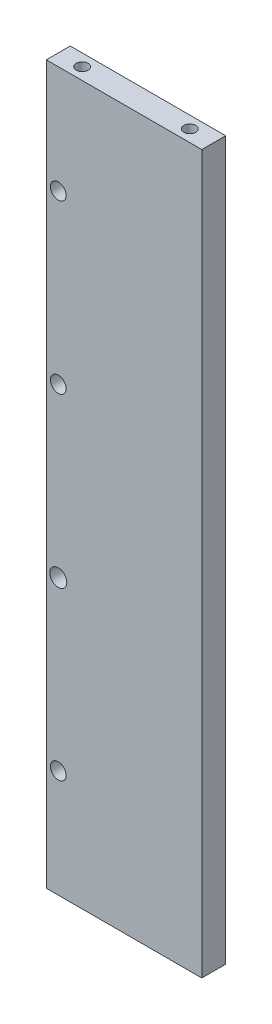
ISO-10303-21;
HEADER;
FILE_DESCRIPTION(('STEP AP214'),'2;1');
FILE_NAME('part.step','',(''),(''),'','','');
FILE_SCHEMA(('AUTOMOTIVE_DESIGN { 1 0 10303 214 1 1 1 1 }'));
ENDSEC;
DATA;
#1=APPLICATION_CONTEXT('core data for automotive mechanical design processes');
#2=APPLICATION_PROTOCOL_DEFINITION('international standard','automotive_design',2000,#1);
#3=PRODUCT_CONTEXT('',#1,'mechanical');
#4=PRODUCT('Part','Part','',(#3));
#5=PRODUCT_RELATED_PRODUCT_CATEGORY('part','',(#4));
#6=PRODUCT_DEFINITION_FORMATION('','',#4);
#7=PRODUCT_DEFINITION_CONTEXT('part definition',#1,'design');
#8=PRODUCT_DEFINITION('design','',#6,#7);
#9=PRODUCT_DEFINITION_SHAPE('','',#8);
#10=(LENGTH_UNIT() NAMED_UNIT(*) SI_UNIT(.MILLI.,.METRE.));
#11=(NAMED_UNIT(*) PLANE_ANGLE_UNIT() SI_UNIT($,.RADIAN.));
#12=(NAMED_UNIT(*) SI_UNIT($,.STERADIAN.) SOLID_ANGLE_UNIT());
#13=UNCERTAINTY_MEASURE_WITH_UNIT(LENGTH_MEASURE(1.E-05),#10,'distance_accuracy_value','');
#14=(GEOMETRIC_REPRESENTATION_CONTEXT(3) GLOBAL_UNCERTAINTY_ASSIGNED_CONTEXT((#13)) GLOBAL_UNIT_ASSIGNED_CONTEXT((#10,
#11,#12)) REPRESENTATION_CONTEXT('',''));
#15=CARTESIAN_POINT('',(0.,0.,0.));
#16=DIRECTION('',(0.,0.,1.));
#17=DIRECTION('',(1.,0.,0.));
#18=AXIS2_PLACEMENT_3D('',#15,#16,#17);
#19=CARTESIAN_POINT('',(0.,0.,10.));
#20=DIRECTION('',(1.,0.,0.));
#21=DIRECTION('',(0.,0.,-1.));
#22=AXIS2_PLACEMENT_3D('',#19,#20,#21);
#23=PLANE('',#22);
#24=DIRECTION('',(0.,-1.,0.));
#25=VECTOR('',#24,1.);
#26=CARTESIAN_POINT('',(0.,0.,0.));
#27=LINE('',#26,#25);
#28=CARTESIAN_POINT('',(0.,300.,0.));
#29=VERTEX_POINT('',#28);
#30=CARTESIAN_POINT('',(0.,0.,0.));
#31=VERTEX_POINT('',#30);
#32=EDGE_CURVE('E133',#29,#31,#27,.T.);
#33=ORIENTED_EDGE('',*,*,#32,.T.);
#34=DIRECTION('',(0.,0.,-1.));
#35=VECTOR('',#34,1.);
#36=CARTESIAN_POINT('',(0.,0.,10.));
#37=LINE('',#36,#35);
#38=CARTESIAN_POINT('',(0.,0.,10.));
#39=VERTEX_POINT('',#38);
#40=EDGE_CURVE('E11',#39,#31,#37,.T.);
#41=ORIENTED_EDGE('',*,*,#40,.F.);
#42=DIRECTION('',(0.,-1.,0.));
#43=VECTOR('',#42,1.);
#44=CARTESIAN_POINT('',(0.,0.,10.));
#45=LINE('',#44,#43);
#46=CARTESIAN_POINT('',(0.,300.,10.));
#47=VERTEX_POINT('',#46);
#48=EDGE_CURVE('E134',#47,#39,#45,.T.);
#49=ORIENTED_EDGE('',*,*,#48,.F.);
#50=DIRECTION('',(0.,0.,-1.));
#51=VECTOR('',#50,1.);
#52=CARTESIAN_POINT('',(0.,300.,10.));
#53=LINE('',#52,#51);
#54=EDGE_CURVE('E140',#47,#29,#53,.T.);
#55=ORIENTED_EDGE('',*,*,#54,.T.);
#56=EDGE_LOOP('',(#33,#41,#49,#55));
#57=FACE_BOUND('',#56,.T.);
#58=ADVANCED_FACE('F38',(#57),#23,.F.);
#59=CARTESIAN_POINT('',(0.,0.,10.));
#60=DIRECTION('',(0.,1.,0.));
#61=DIRECTION('',(0.,0.,1.));
#62=AXIS2_PLACEMENT_3D('',#59,#60,#61);
#63=PLANE('',#62);
#64=CARTESIAN_POINT('',(55.,0.,5.));
#65=DIRECTION('',(0.,-1.,0.));
#66=DIRECTION('',(0.,0.,-1.));
#67=AXIS2_PLACEMENT_3D('',#64,#65,#66);
#68=CIRCLE('',#67,2.49999999999999);
#69=CARTESIAN_POINT('',(55.,0.,2.50000000000001));
#70=VERTEX_POINT('',#69);
#71=EDGE_CURVE('E121',#70,#70,#68,.T.);
#72=ORIENTED_EDGE('',*,*,#71,.F.);
#73=EDGE_LOOP('',(#72));
#74=FACE_BOUND('',#73,.T.);
#75=CARTESIAN_POINT('',(10.,0.,5.));
#76=DIRECTION('',(0.,-1.,0.));
#77=DIRECTION('',(0.,0.,-1.));
#78=AXIS2_PLACEMENT_3D('',#75,#76,#77);
#79=CIRCLE('',#78,2.49999999999999);
#80=CARTESIAN_POINT('',(10.,0.,2.50000000000001));
#81=VERTEX_POINT('',#80);
#82=EDGE_CURVE('E127',#81,#81,#79,.T.);
#83=ORIENTED_EDGE('',*,*,#82,.F.);
#84=EDGE_LOOP('',(#83));
#85=FACE_BOUND('',#84,.T.);
#86=DIRECTION('',(1.,0.,0.));
#87=VECTOR('',#86,1.);
#88=CARTESIAN_POINT('',(0.,0.,0.));
#89=LINE('',#88,#87);
#90=CARTESIAN_POINT('',(65.,0.,0.));
#91=VERTEX_POINT('',#90);
#92=EDGE_CURVE('E143',#31,#91,#89,.T.);
#93=ORIENTED_EDGE('',*,*,#92,.T.);
#94=DIRECTION('',(0.,0.,-1.));
#95=VECTOR('',#94,1.);
#96=CARTESIAN_POINT('',(65.,0.,10.));
#97=LINE('',#96,#95);
#98=CARTESIAN_POINT('',(65.,0.,10.));
#99=VERTEX_POINT('',#98);
#100=EDGE_CURVE('E46',#99,#91,#97,.T.);
#101=ORIENTED_EDGE('',*,*,#100,.F.);
#102=DIRECTION('',(1.,0.,0.));
#103=VECTOR('',#102,1.);
#104=CARTESIAN_POINT('',(0.,0.,10.));
#105=LINE('',#104,#103);
#106=EDGE_CURVE('E85',#39,#99,#105,.T.);
#107=ORIENTED_EDGE('',*,*,#106,.F.);
#108=ORIENTED_EDGE('',*,*,#40,.T.);
#109=EDGE_LOOP('',(#93,#101,#107,#108));
#110=FACE_BOUND('',#109,.T.);
#111=ADVANCED_FACE('F168',(#74,#85,#110),#63,.F.);
#112=CARTESIAN_POINT('',(65.,0.,10.));
#113=DIRECTION('',(-1.,0.,0.));
#114=DIRECTION('',(0.,0.,1.));
#115=AXIS2_PLACEMENT_3D('',#112,#113,#114);
#116=PLANE('',#115);
#117=DIRECTION('',(0.,1.,0.));
#118=VECTOR('',#117,1.);
#119=CARTESIAN_POINT('',(65.,0.,0.));
#120=LINE('',#119,#118);
#121=CARTESIAN_POINT('',(65.,300.,0.));
#122=VERTEX_POINT('',#121);
#123=EDGE_CURVE('E72',#91,#122,#120,.T.);
#124=ORIENTED_EDGE('',*,*,#123,.T.);
#125=DIRECTION('',(0.,0.,-1.));
#126=VECTOR('',#125,1.);
#127=CARTESIAN_POINT('',(65.,300.,10.));
#128=LINE('',#127,#126);
#129=CARTESIAN_POINT('',(65.,300.,10.));
#130=VERTEX_POINT('',#129);
#131=EDGE_CURVE('E148',#130,#122,#128,.T.);
#132=ORIENTED_EDGE('',*,*,#131,.F.);
#133=DIRECTION('',(0.,1.,0.));
#134=VECTOR('',#133,1.);
#135=CARTESIAN_POINT('',(65.,0.,10.));
#136=LINE('',#135,#134);
#137=EDGE_CURVE('E137',#99,#130,#136,.T.);
#138=ORIENTED_EDGE('',*,*,#137,.F.);
#139=ORIENTED_EDGE('',*,*,#100,.T.);
#140=EDGE_LOOP('',(#124,#132,#138,#139));
#141=FACE_BOUND('',#140,.T.);
#142=ADVANCED_FACE('F150',(#141),#116,.F.);
#143=CARTESIAN_POINT('',(0.,300.,10.));
#144=DIRECTION('',(0.,-1.,0.));
#145=DIRECTION('',(0.,0.,-1.));
#146=AXIS2_PLACEMENT_3D('',#143,#144,#145);
#147=PLANE('',#146);
#148=CARTESIAN_POINT('',(10.,300.,5.));
#149=DIRECTION('',(0.,1.,0.));
#150=DIRECTION('',(0.,0.,1.));
#151=AXIS2_PLACEMENT_3D('',#148,#149,#150);
#152=CIRCLE('',#151,2.49999999999999);
#153=CARTESIAN_POINT('',(10.,300.,7.49999999999999));
#154=VERTEX_POINT('',#153);
#155=EDGE_CURVE('E109',#154,#154,#152,.T.);
#156=ORIENTED_EDGE('',*,*,#155,.F.);
#157=EDGE_LOOP('',(#156));
#158=FACE_BOUND('',#157,.T.);
#159=CARTESIAN_POINT('',(55.,300.,5.));
#160=DIRECTION('',(0.,1.,0.));
#161=DIRECTION('',(0.,0.,1.));
#162=AXIS2_PLACEMENT_3D('',#159,#160,#161);
#163=CIRCLE('',#162,2.49999999999999);
#164=CARTESIAN_POINT('',(55.,300.,7.49999999999999));
#165=VERTEX_POINT('',#164);
#166=EDGE_CURVE('E108',#165,#165,#163,.T.);
#167=ORIENTED_EDGE('',*,*,#166,.F.);
#168=EDGE_LOOP('',(#167));
#169=FACE_BOUND('',#168,.T.);
#170=DIRECTION('',(-1.,0.,0.));
#171=VECTOR('',#170,1.);
#172=CARTESIAN_POINT('',(0.,300.,0.));
#173=LINE('',#172,#171);
#174=EDGE_CURVE('E78',#122,#29,#173,.T.);
#175=ORIENTED_EDGE('',*,*,#174,.T.);
#176=ORIENTED_EDGE('',*,*,#54,.F.);
#177=DIRECTION('',(-1.,0.,0.));
#178=VECTOR('',#177,1.);
#179=CARTESIAN_POINT('',(0.,300.,10.));
#180=LINE('',#179,#178);
#181=EDGE_CURVE('E54',#130,#47,#180,.T.);
#182=ORIENTED_EDGE('',*,*,#181,.F.);
#183=ORIENTED_EDGE('',*,*,#131,.T.);
#184=EDGE_LOOP('',(#175,#176,#182,#183));
#185=FACE_BOUND('',#184,.T.);
#186=ADVANCED_FACE('F157',(#158,#169,#185),#147,.F.);
#187=CARTESIAN_POINT('',(0.,0.,10.));
#188=DIRECTION('',(0.,0.,-1.));
#189=DIRECTION('',(-1.,0.,0.));
#190=AXIS2_PLACEMENT_3D('',#187,#188,#189);
#191=PLANE('',#190);
#192=CARTESIAN_POINT('',(5.,185.,10.));
#193=DIRECTION('',(0.,0.,1.));
#194=DIRECTION('',(1.,0.,0.));
#195=AXIS2_PLACEMENT_3D('',#192,#193,#194);
#196=CIRCLE('',#195,3.3);
#197=CARTESIAN_POINT('',(8.3,185.,10.));
#198=VERTEX_POINT('',#197);
#199=EDGE_CURVE('E232',#198,#198,#196,.T.);
#200=ORIENTED_EDGE('',*,*,#199,.F.);
#201=EDGE_LOOP('',(#200));
#202=FACE_BOUND('',#201,.T.);
#203=CARTESIAN_POINT('',(5.,45.,10.));
#204=DIRECTION('',(0.,0.,1.));
#205=DIRECTION('',(1.,0.,0.));
#206=AXIS2_PLACEMENT_3D('',#203,#204,#205);
#207=CIRCLE('',#206,3.3);
#208=CARTESIAN_POINT('',(8.3,45.,10.));
#209=VERTEX_POINT('',#208);
#210=EDGE_CURVE('E228',#209,#209,#207,.T.);
#211=ORIENTED_EDGE('',*,*,#210,.F.);
#212=EDGE_LOOP('',(#211));
#213=FACE_BOUND('',#212,.T.);
#214=CARTESIAN_POINT('',(5.,115.,10.));
#215=DIRECTION('',(0.,0.,1.));
#216=DIRECTION('',(1.,0.,0.));
#217=AXIS2_PLACEMENT_3D('',#214,#215,#216);
#218=CIRCLE('',#217,3.55507043240184);
#219=CARTESIAN_POINT('',(8.55507043240184,115.,10.));
#220=VERTEX_POINT('',#219);
#221=EDGE_CURVE('E224',#220,#220,#218,.T.);
#222=ORIENTED_EDGE('',*,*,#221,.F.);
#223=EDGE_LOOP('',(#222));
#224=FACE_BOUND('',#223,.T.);
#225=CARTESIAN_POINT('',(5.,255.,10.));
#226=DIRECTION('',(0.,0.,1.));
#227=DIRECTION('',(1.,0.,0.));
#228=AXIS2_PLACEMENT_3D('',#225,#226,#227);
#229=CIRCLE('',#228,3.30000000000002);
#230=CARTESIAN_POINT('',(8.30000000000002,255.,10.));
#231=VERTEX_POINT('',#230);
#232=EDGE_CURVE('E220',#231,#231,#229,.T.);
#233=ORIENTED_EDGE('',*,*,#232,.F.);
#234=EDGE_LOOP('',(#233));
#235=FACE_BOUND('',#234,.T.);
#236=ORIENTED_EDGE('',*,*,#48,.T.);
#237=ORIENTED_EDGE('',*,*,#106,.T.);
#238=ORIENTED_EDGE('',*,*,#137,.T.);
#239=ORIENTED_EDGE('',*,*,#181,.T.);
#240=EDGE_LOOP('',(#236,#237,#238,#239));
#241=FACE_BOUND('',#240,.T.);
#242=ADVANCED_FACE('F159',(#202,#213,#224,#235,#241),#191,.F.);
#243=CARTESIAN_POINT('',(0.,0.,0.));
#244=DIRECTION('',(0.,0.,-1.));
#245=DIRECTION('',(-1.,0.,0.));
#246=AXIS2_PLACEMENT_3D('',#243,#244,#245);
#247=PLANE('',#246);
#248=CARTESIAN_POINT('',(5.,185.,0.));
#249=DIRECTION('',(0.,0.,1.));
#250=DIRECTION('',(1.,0.,0.));
#251=AXIS2_PLACEMENT_3D('',#248,#249,#250);
#252=CIRCLE('',#251,3.3);
#253=CARTESIAN_POINT('',(8.3,185.,0.));
#254=VERTEX_POINT('',#253);
#255=EDGE_CURVE('E208',#254,#254,#252,.T.);
#256=ORIENTED_EDGE('',*,*,#255,.T.);
#257=EDGE_LOOP('',(#256));
#258=FACE_BOUND('',#257,.T.);
#259=CARTESIAN_POINT('',(5.,45.,0.));
#260=DIRECTION('',(0.,0.,1.));
#261=DIRECTION('',(1.,0.,0.));
#262=AXIS2_PLACEMENT_3D('',#259,#260,#261);
#263=CIRCLE('',#262,3.3);
#264=CARTESIAN_POINT('',(8.3,45.,0.));
#265=VERTEX_POINT('',#264);
#266=EDGE_CURVE('E212',#265,#265,#263,.T.);
#267=ORIENTED_EDGE('',*,*,#266,.T.);
#268=EDGE_LOOP('',(#267));
#269=FACE_BOUND('',#268,.T.);
#270=CARTESIAN_POINT('',(5.,115.,0.));
#271=DIRECTION('',(0.,0.,1.));
#272=DIRECTION('',(1.,0.,0.));
#273=AXIS2_PLACEMENT_3D('',#270,#271,#272);
#274=CIRCLE('',#273,3.55507043240184);
#275=CARTESIAN_POINT('',(8.55507043240184,115.,0.));
#276=VERTEX_POINT('',#275);
#277=EDGE_CURVE('E216',#276,#276,#274,.T.);
#278=ORIENTED_EDGE('',*,*,#277,.T.);
#279=EDGE_LOOP('',(#278));
#280=FACE_BOUND('',#279,.T.);
#281=CARTESIAN_POINT('',(5.,255.,0.));
#282=DIRECTION('',(0.,0.,1.));
#283=DIRECTION('',(1.,0.,0.));
#284=AXIS2_PLACEMENT_3D('',#281,#282,#283);
#285=CIRCLE('',#284,3.30000000000002);
#286=CARTESIAN_POINT('',(8.30000000000002,255.,0.));
#287=VERTEX_POINT('',#286);
#288=EDGE_CURVE('E115',#287,#287,#285,.T.);
#289=ORIENTED_EDGE('',*,*,#288,.T.);
#290=EDGE_LOOP('',(#289));
#291=FACE_BOUND('',#290,.T.);
#292=ORIENTED_EDGE('',*,*,#32,.F.);
#293=ORIENTED_EDGE('',*,*,#174,.F.);
#294=ORIENTED_EDGE('',*,*,#123,.F.);
#295=ORIENTED_EDGE('',*,*,#92,.F.);
#296=EDGE_LOOP('',(#292,#293,#294,#295));
#297=FACE_BOUND('',#296,.T.);
#298=ADVANCED_FACE('F153',(#258,#269,#280,#291,#297),#247,.T.);
#299=CARTESIAN_POINT('',(10.,20.,5.));
#300=DIRECTION('',(0.,-1.,0.));
#301=DIRECTION('',(0.,0.,-1.));
#302=AXIS2_PLACEMENT_3D('',#299,#300,#301);
#303=CONICAL_SURFACE('',#302,2.49999999999999,1.02974425867665);
#304=CARTESIAN_POINT('',(9.99999999999999,21.5021515475689,5.));
#305=VERTEX_POINT('',#304);
#306=VERTEX_LOOP('',#305);
#307=FACE_BOUND('',#306,.T.);
#308=CARTESIAN_POINT('',(10.,20.,5.));
#309=DIRECTION('',(0.,-1.,0.));
#310=DIRECTION('',(0.,0.,-1.));
#311=AXIS2_PLACEMENT_3D('',#308,#309,#310);
#312=CIRCLE('',#311,2.49999999999999);
#313=CARTESIAN_POINT('',(10.,20.,2.50000000000001));
#314=VERTEX_POINT('',#313);
#315=EDGE_CURVE('E130',#314,#314,#312,.T.);
#316=ORIENTED_EDGE('',*,*,#315,.T.);
#317=EDGE_LOOP('',(#316));
#318=FACE_BOUND('',#317,.T.);
#319=ADVANCED_FACE('F187',(#307,#318),#303,.F.);
#320=CARTESIAN_POINT('',(10.,0.,5.));
#321=DIRECTION('',(0.,-1.,0.));
#322=DIRECTION('',(0.,0.,-1.));
#323=AXIS2_PLACEMENT_3D('',#320,#321,#322);
#324=CYLINDRICAL_SURFACE('',#323,2.49999999999999);
#325=ORIENTED_EDGE('',*,*,#315,.F.);
#326=EDGE_LOOP('',(#325));
#327=FACE_BOUND('',#326,.T.);
#328=ORIENTED_EDGE('',*,*,#82,.T.);
#329=EDGE_LOOP('',(#328));
#330=FACE_BOUND('',#329,.T.);
#331=ADVANCED_FACE('F184',(#327,#330),#324,.F.);
#332=CARTESIAN_POINT('',(55.,20.,5.));
#333=DIRECTION('',(0.,-1.,0.));
#334=DIRECTION('',(0.,0.,-1.));
#335=AXIS2_PLACEMENT_3D('',#332,#333,#334);
#336=CONICAL_SURFACE('',#335,2.49999999999999,1.02974425867665);
#337=CARTESIAN_POINT('',(55.,21.5021515475689,5.));
#338=VERTEX_POINT('',#337);
#339=VERTEX_LOOP('',#338);
#340=FACE_BOUND('',#339,.T.);
#341=CARTESIAN_POINT('',(55.,20.,5.));
#342=DIRECTION('',(0.,-1.,0.));
#343=DIRECTION('',(0.,0.,-1.));
#344=AXIS2_PLACEMENT_3D('',#341,#342,#343);
#345=CIRCLE('',#344,2.49999999999999);
#346=CARTESIAN_POINT('',(55.,20.,2.50000000000001));
#347=VERTEX_POINT('',#346);
#348=EDGE_CURVE('E124',#347,#347,#345,.T.);
#349=ORIENTED_EDGE('',*,*,#348,.T.);
#350=EDGE_LOOP('',(#349));
#351=FACE_BOUND('',#350,.T.);
#352=ADVANCED_FACE('F186',(#340,#351),#336,.F.);
#353=CARTESIAN_POINT('',(55.,0.,5.));
#354=DIRECTION('',(0.,-1.,0.));
#355=DIRECTION('',(0.,0.,-1.));
#356=AXIS2_PLACEMENT_3D('',#353,#354,#355);
#357=CYLINDRICAL_SURFACE('',#356,2.49999999999999);
#358=ORIENTED_EDGE('',*,*,#348,.F.);
#359=EDGE_LOOP('',(#358));
#360=FACE_BOUND('',#359,.T.);
#361=ORIENTED_EDGE('',*,*,#71,.T.);
#362=EDGE_LOOP('',(#361));
#363=FACE_BOUND('',#362,.T.);
#364=ADVANCED_FACE('F194',(#360,#363),#357,.F.);
#365=CARTESIAN_POINT('',(55.,277.,5.));
#366=DIRECTION('',(0.,1.,0.));
#367=DIRECTION('',(0.,0.,1.));
#368=AXIS2_PLACEMENT_3D('',#365,#366,#367);
#369=CONICAL_SURFACE('',#368,2.5,1.02974425867666);
#370=CARTESIAN_POINT('',(55.,275.497848452431,5.));
#371=VERTEX_POINT('',#370);
#372=VERTEX_LOOP('',#371);
#373=FACE_BOUND('',#372,.T.);
#374=CARTESIAN_POINT('',(55.,277.,5.));
#375=DIRECTION('',(0.,1.,0.));
#376=DIRECTION('',(0.,0.,1.));
#377=AXIS2_PLACEMENT_3D('',#374,#375,#376);
#378=CIRCLE('',#377,2.5);
#379=CARTESIAN_POINT('',(55.,277.,7.5));
#380=VERTEX_POINT('',#379);
#381=EDGE_CURVE('E112',#380,#380,#378,.T.);
#382=ORIENTED_EDGE('',*,*,#381,.T.);
#383=EDGE_LOOP('',(#382));
#384=FACE_BOUND('',#383,.T.);
#385=ADVANCED_FACE('F261',(#373,#384),#369,.F.);
#386=CARTESIAN_POINT('',(55.,300.,5.));
#387=DIRECTION('',(0.,1.,0.));
#388=DIRECTION('',(0.,0.,1.));
#389=AXIS2_PLACEMENT_3D('',#386,#387,#388);
#390=CYLINDRICAL_SURFACE('',#389,2.49999999999999);
#391=ORIENTED_EDGE('',*,*,#381,.F.);
#392=EDGE_LOOP('',(#391));
#393=FACE_BOUND('',#392,.T.);
#394=ORIENTED_EDGE('',*,*,#166,.T.);
#395=EDGE_LOOP('',(#394));
#396=FACE_BOUND('',#395,.T.);
#397=ADVANCED_FACE('F102',(#393,#396),#390,.F.);
#398=CARTESIAN_POINT('',(10.,277.,5.));
#399=DIRECTION('',(0.,1.,0.));
#400=DIRECTION('',(0.,0.,1.));
#401=AXIS2_PLACEMENT_3D('',#398,#399,#400);
#402=CONICAL_SURFACE('',#401,2.5,1.02974425867666);
#403=CARTESIAN_POINT('',(10.,275.497848452431,5.));
#404=VERTEX_POINT('',#403);
#405=VERTEX_LOOP('',#404);
#406=FACE_BOUND('',#405,.T.);
#407=CARTESIAN_POINT('',(10.,277.,5.));
#408=DIRECTION('',(0.,1.,0.));
#409=DIRECTION('',(0.,0.,1.));
#410=AXIS2_PLACEMENT_3D('',#407,#408,#409);
#411=CIRCLE('',#410,2.5);
#412=CARTESIAN_POINT('',(10.,277.,7.49999999999999));
#413=VERTEX_POINT('',#412);
#414=EDGE_CURVE('E106',#413,#413,#411,.T.);
#415=ORIENTED_EDGE('',*,*,#414,.T.);
#416=EDGE_LOOP('',(#415));
#417=FACE_BOUND('',#416,.T.);
#418=ADVANCED_FACE('F98',(#406,#417),#402,.F.);
#419=CARTESIAN_POINT('',(10.,300.,5.));
#420=DIRECTION('',(0.,1.,0.));
#421=DIRECTION('',(0.,0.,1.));
#422=AXIS2_PLACEMENT_3D('',#419,#420,#421);
#423=CYLINDRICAL_SURFACE('',#422,2.49999999999999);
#424=ORIENTED_EDGE('',*,*,#414,.F.);
#425=EDGE_LOOP('',(#424));
#426=FACE_BOUND('',#425,.T.);
#427=ORIENTED_EDGE('',*,*,#155,.T.);
#428=EDGE_LOOP('',(#427));
#429=FACE_BOUND('',#428,.T.);
#430=ADVANCED_FACE('F101',(#426,#429),#423,.F.);
#431=CARTESIAN_POINT('',(5.,255.,0.));
#432=DIRECTION('',(0.,0.,1.));
#433=DIRECTION('',(1.,0.,0.));
#434=AXIS2_PLACEMENT_3D('',#431,#432,#433);
#435=CYLINDRICAL_SURFACE('',#434,3.30000000000002);
#436=ORIENTED_EDGE('',*,*,#288,.F.);
#437=EDGE_LOOP('',(#436));
#438=FACE_BOUND('',#437,.T.);
#439=ORIENTED_EDGE('',*,*,#232,.T.);
#440=EDGE_LOOP('',(#439));
#441=FACE_BOUND('',#440,.T.);
#442=ADVANCED_FACE('F245',(#438,#441),#435,.F.);
#443=CARTESIAN_POINT('',(5.,115.,0.));
#444=DIRECTION('',(0.,0.,1.));
#445=DIRECTION('',(1.,0.,0.));
#446=AXIS2_PLACEMENT_3D('',#443,#444,#445);
#447=CYLINDRICAL_SURFACE('',#446,3.55507043240184);
#448=ORIENTED_EDGE('',*,*,#277,.F.);
#449=EDGE_LOOP('',(#448));
#450=FACE_BOUND('',#449,.T.);
#451=ORIENTED_EDGE('',*,*,#221,.T.);
#452=EDGE_LOOP('',(#451));
#453=FACE_BOUND('',#452,.T.);
#454=ADVANCED_FACE('F247',(#450,#453),#447,.F.);
#455=CARTESIAN_POINT('',(5.,45.,0.));
#456=DIRECTION('',(0.,0.,1.));
#457=DIRECTION('',(1.,0.,0.));
#458=AXIS2_PLACEMENT_3D('',#455,#456,#457);
#459=CYLINDRICAL_SURFACE('',#458,3.3);
#460=ORIENTED_EDGE('',*,*,#266,.F.);
#461=EDGE_LOOP('',(#460));
#462=FACE_BOUND('',#461,.T.);
#463=ORIENTED_EDGE('',*,*,#210,.T.);
#464=EDGE_LOOP('',(#463));
#465=FACE_BOUND('',#464,.T.);
#466=ADVANCED_FACE('F253',(#462,#465),#459,.F.);
#467=CARTESIAN_POINT('',(5.,185.,0.));
#468=DIRECTION('',(0.,0.,1.));
#469=DIRECTION('',(1.,0.,0.));
#470=AXIS2_PLACEMENT_3D('',#467,#468,#469);
#471=CYLINDRICAL_SURFACE('',#470,3.3);
#472=ORIENTED_EDGE('',*,*,#255,.F.);
#473=EDGE_LOOP('',(#472));
#474=FACE_BOUND('',#473,.T.);
#475=ORIENTED_EDGE('',*,*,#199,.T.);
#476=EDGE_LOOP('',(#475));
#477=FACE_BOUND('',#476,.T.);
#478=ADVANCED_FACE('F237',(#474,#477),#471,.F.);
#479=CLOSED_SHELL('',(#58,#111,#142,#186,#242,#298,#319,#331,#352,#364,#385,#397,#418,#430,#442,
#454,#466,#478));
#480=MANIFOLD_SOLID_BREP('B2',#479);
#481=ADVANCED_BREP_SHAPE_REPRESENTATION('',(#18,#480),#14);
#482=SHAPE_DEFINITION_REPRESENTATION(#9,#481);
ENDSEC;
END-ISO-10303-21;
